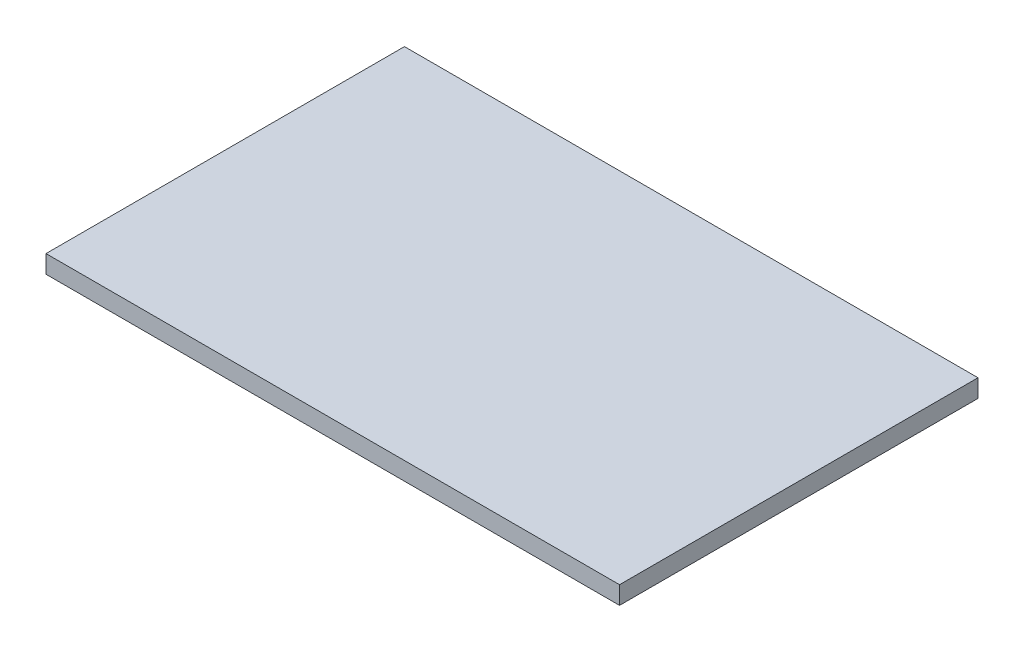
ISO-10303-21;
HEADER;
FILE_DESCRIPTION(('STEP AP214'),'2;1');
FILE_NAME('part.step','',(''),(''),'','','');
FILE_SCHEMA(('AUTOMOTIVE_DESIGN { 1 0 10303 214 1 1 1 1 }'));
ENDSEC;
DATA;
#1=APPLICATION_CONTEXT('core data for automotive mechanical design processes');
#2=APPLICATION_PROTOCOL_DEFINITION('international standard','automotive_design',2000,#1);
#3=PRODUCT_CONTEXT('',#1,'mechanical');
#4=PRODUCT('Part','Part','',(#3));
#5=PRODUCT_RELATED_PRODUCT_CATEGORY('part','',(#4));
#6=PRODUCT_DEFINITION_FORMATION('','',#4);
#7=PRODUCT_DEFINITION_CONTEXT('part definition',#1,'design');
#8=PRODUCT_DEFINITION('design','',#6,#7);
#9=PRODUCT_DEFINITION_SHAPE('','',#8);
#10=(LENGTH_UNIT() NAMED_UNIT(*) SI_UNIT(.MILLI.,.METRE.));
#11=(NAMED_UNIT(*) PLANE_ANGLE_UNIT() SI_UNIT($,.RADIAN.));
#12=(NAMED_UNIT(*) SI_UNIT($,.STERADIAN.) SOLID_ANGLE_UNIT());
#13=UNCERTAINTY_MEASURE_WITH_UNIT(LENGTH_MEASURE(1.E-05),#10,'distance_accuracy_value','');
#14=(GEOMETRIC_REPRESENTATION_CONTEXT(3) GLOBAL_UNCERTAINTY_ASSIGNED_CONTEXT((#13)) GLOBAL_UNIT_ASSIGNED_CONTEXT((#10,
#11,#12)) REPRESENTATION_CONTEXT('',''));
#15=CARTESIAN_POINT('',(0.,0.,0.));
#16=DIRECTION('',(0.,0.,1.));
#17=DIRECTION('',(1.,0.,0.));
#18=AXIS2_PLACEMENT_3D('',#15,#16,#17);
#19=CARTESIAN_POINT('',(112.600005306465,5.,-79.3332779512127));
#20=DIRECTION('',(-1.,0.,0.));
#21=DIRECTION('',(0.,0.,1.));
#22=AXIS2_PLACEMENT_3D('',#19,#20,#21);
#23=PLANE('',#22);
#24=DIRECTION('',(0.,0.,-1.));
#25=VECTOR('',#24,1.);
#26=CARTESIAN_POINT('',(112.600005306465,0.,-79.3332779512127));
#27=LINE('',#26,#25);
#28=CARTESIAN_POINT('',(112.600005306465,0.,20.6667220487873));
#29=VERTEX_POINT('',#28);
#30=CARTESIAN_POINT('',(112.600005306465,0.,-79.3332779512127));
#31=VERTEX_POINT('',#30);
#32=EDGE_CURVE('E95',#29,#31,#27,.T.);
#33=ORIENTED_EDGE('',*,*,#32,.T.);
#34=DIRECTION('',(0.,-1.,0.));
#35=VECTOR('',#34,1.);
#36=CARTESIAN_POINT('',(112.600005306465,5.,-79.3332779512127));
#37=LINE('',#36,#35);
#38=CARTESIAN_POINT('',(112.600005306465,5.,-79.3332779512127));
#39=VERTEX_POINT('',#38);
#40=EDGE_CURVE('E11',#39,#31,#37,.T.);
#41=ORIENTED_EDGE('',*,*,#40,.F.);
#42=DIRECTION('',(0.,0.,-1.));
#43=VECTOR('',#42,1.);
#44=CARTESIAN_POINT('',(112.600005306465,5.,-79.3332779512127));
#45=LINE('',#44,#43);
#46=CARTESIAN_POINT('',(112.600005306465,5.,20.6667220487873));
#47=VERTEX_POINT('',#46);
#48=EDGE_CURVE('E83',#47,#39,#45,.T.);
#49=ORIENTED_EDGE('',*,*,#48,.F.);
#50=DIRECTION('',(0.,-1.,0.));
#51=VECTOR('',#50,1.);
#52=CARTESIAN_POINT('',(112.600005306465,5.,20.6667220487873));
#53=LINE('',#52,#51);
#54=EDGE_CURVE('E91',#47,#29,#53,.T.);
#55=ORIENTED_EDGE('',*,*,#54,.T.);
#56=EDGE_LOOP('',(#33,#41,#49,#55));
#57=FACE_BOUND('',#56,.T.);
#58=ADVANCED_FACE('F32',(#57),#23,.F.);
#59=CARTESIAN_POINT('',(112.600005306465,5.,-79.3332779512127));
#60=DIRECTION('',(0.,0.,1.));
#61=DIRECTION('',(1.,0.,0.));
#62=AXIS2_PLACEMENT_3D('',#59,#60,#61);
#63=PLANE('',#62);
#64=DIRECTION('',(-1.,0.,0.));
#65=VECTOR('',#64,1.);
#66=CARTESIAN_POINT('',(112.600005306465,0.,-79.3332779512127));
#67=LINE('',#66,#65);
#68=CARTESIAN_POINT('',(-47.3999946935351,0.,-79.3332779512127));
#69=VERTEX_POINT('',#68);
#70=EDGE_CURVE('E87',#31,#69,#67,.T.);
#71=ORIENTED_EDGE('',*,*,#70,.T.);
#72=DIRECTION('',(0.,-1.,0.));
#73=VECTOR('',#72,1.);
#74=CARTESIAN_POINT('',(-47.3999946935351,5.,-79.3332779512127));
#75=LINE('',#74,#73);
#76=CARTESIAN_POINT('',(-47.3999946935351,5.,-79.3332779512127));
#77=VERTEX_POINT('',#76);
#78=EDGE_CURVE('E40',#77,#69,#75,.T.);
#79=ORIENTED_EDGE('',*,*,#78,.F.);
#80=DIRECTION('',(-1.,0.,0.));
#81=VECTOR('',#80,1.);
#82=CARTESIAN_POINT('',(112.600005306465,5.,-79.3332779512127));
#83=LINE('',#82,#81);
#84=EDGE_CURVE('E78',#39,#77,#83,.T.);
#85=ORIENTED_EDGE('',*,*,#84,.F.);
#86=ORIENTED_EDGE('',*,*,#40,.T.);
#87=EDGE_LOOP('',(#71,#79,#85,#86));
#88=FACE_BOUND('',#87,.T.);
#89=ADVANCED_FACE('F86',(#88),#63,.F.);
#90=CARTESIAN_POINT('',(-47.3999946935351,5.,-79.3332779512127));
#91=DIRECTION('',(1.,0.,0.));
#92=DIRECTION('',(0.,0.,-1.));
#93=AXIS2_PLACEMENT_3D('',#90,#91,#92);
#94=PLANE('',#93);
#95=DIRECTION('',(0.,0.,1.));
#96=VECTOR('',#95,1.);
#97=CARTESIAN_POINT('',(-47.3999946935351,0.,-79.3332779512127));
#98=LINE('',#97,#96);
#99=CARTESIAN_POINT('',(-47.3999946935351,0.,20.6667220487873));
#100=VERTEX_POINT('',#99);
#101=EDGE_CURVE('E65',#69,#100,#98,.T.);
#102=ORIENTED_EDGE('',*,*,#101,.T.);
#103=DIRECTION('',(0.,-1.,0.));
#104=VECTOR('',#103,1.);
#105=CARTESIAN_POINT('',(-47.3999946935351,5.,20.6667220487873));
#106=LINE('',#105,#104);
#107=CARTESIAN_POINT('',(-47.3999946935351,5.,20.6667220487873));
#108=VERTEX_POINT('',#107);
#109=EDGE_CURVE('E88',#108,#100,#106,.T.);
#110=ORIENTED_EDGE('',*,*,#109,.F.);
#111=DIRECTION('',(0.,0.,1.));
#112=VECTOR('',#111,1.);
#113=CARTESIAN_POINT('',(-47.3999946935351,5.,-79.3332779512127));
#114=LINE('',#113,#112);
#115=EDGE_CURVE('E81',#77,#108,#114,.T.);
#116=ORIENTED_EDGE('',*,*,#115,.F.);
#117=ORIENTED_EDGE('',*,*,#78,.T.);
#118=EDGE_LOOP('',(#102,#110,#116,#117));
#119=FACE_BOUND('',#118,.T.);
#120=ADVANCED_FACE('F89',(#119),#94,.F.);
#121=CARTESIAN_POINT('',(112.600005306465,5.,20.6667220487873));
#122=DIRECTION('',(0.,0.,-1.));
#123=DIRECTION('',(-1.,0.,0.));
#124=AXIS2_PLACEMENT_3D('',#121,#122,#123);
#125=PLANE('',#124);
#126=DIRECTION('',(1.,0.,0.));
#127=VECTOR('',#126,1.);
#128=CARTESIAN_POINT('',(112.600005306465,0.,20.6667220487873));
#129=LINE('',#128,#127);
#130=EDGE_CURVE('E71',#100,#29,#129,.T.);
#131=ORIENTED_EDGE('',*,*,#130,.T.);
#132=ORIENTED_EDGE('',*,*,#54,.F.);
#133=DIRECTION('',(1.,0.,0.));
#134=VECTOR('',#133,1.);
#135=CARTESIAN_POINT('',(112.600005306465,5.,20.6667220487873));
#136=LINE('',#135,#134);
#137=EDGE_CURVE('E48',#108,#47,#136,.T.);
#138=ORIENTED_EDGE('',*,*,#137,.F.);
#139=ORIENTED_EDGE('',*,*,#109,.T.);
#140=EDGE_LOOP('',(#131,#132,#138,#139));
#141=FACE_BOUND('',#140,.T.);
#142=ADVANCED_FACE('F102',(#141),#125,.F.);
#143=CARTESIAN_POINT('',(0.,5.,0.));
#144=DIRECTION('',(0.,-1.,0.));
#145=DIRECTION('',(0.,0.,-1.));
#146=AXIS2_PLACEMENT_3D('',#143,#144,#145);
#147=PLANE('',#146);
#148=ORIENTED_EDGE('',*,*,#48,.T.);
#149=ORIENTED_EDGE('',*,*,#84,.T.);
#150=ORIENTED_EDGE('',*,*,#115,.T.);
#151=ORIENTED_EDGE('',*,*,#137,.T.);
#152=EDGE_LOOP('',(#148,#149,#150,#151));
#153=FACE_BOUND('',#152,.T.);
#154=ADVANCED_FACE('F79',(#153),#147,.F.);
#155=CARTESIAN_POINT('',(0.,0.,0.));
#156=DIRECTION('',(0.,-1.,0.));
#157=DIRECTION('',(0.,0.,-1.));
#158=AXIS2_PLACEMENT_3D('',#155,#156,#157);
#159=PLANE('',#158);
#160=ORIENTED_EDGE('',*,*,#32,.F.);
#161=ORIENTED_EDGE('',*,*,#130,.F.);
#162=ORIENTED_EDGE('',*,*,#101,.F.);
#163=ORIENTED_EDGE('',*,*,#70,.F.);
#164=EDGE_LOOP('',(#160,#161,#162,#163));
#165=FACE_BOUND('',#164,.T.);
#166=ADVANCED_FACE('F105',(#165),#159,.T.);
#167=CLOSED_SHELL('',(#58,#89,#120,#142,#154,#166));
#168=MANIFOLD_SOLID_BREP('B2',#167);
#169=ADVANCED_BREP_SHAPE_REPRESENTATION('',(#18,#168),#14);
#170=SHAPE_DEFINITION_REPRESENTATION(#9,#169);
ENDSEC;
END-ISO-10303-21;
